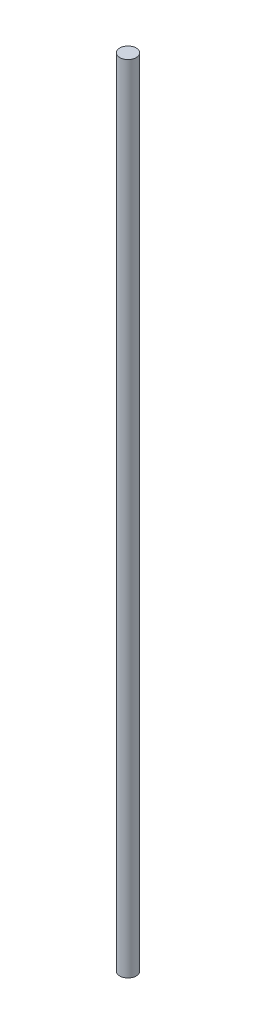
ISO-10303-21;
HEADER;
FILE_DESCRIPTION(('STEP AP214'),'2;1');
FILE_NAME('part.step','',(''),(''),'','','');
FILE_SCHEMA(('AUTOMOTIVE_DESIGN { 1 0 10303 214 1 1 1 1 }'));
ENDSEC;
DATA;
#1=APPLICATION_CONTEXT('core data for automotive mechanical design processes');
#2=APPLICATION_PROTOCOL_DEFINITION('international standard','automotive_design',2000,#1);
#3=PRODUCT_CONTEXT('',#1,'mechanical');
#4=PRODUCT('Part','Part','',(#3));
#5=PRODUCT_RELATED_PRODUCT_CATEGORY('part','',(#4));
#6=PRODUCT_DEFINITION_FORMATION('','',#4);
#7=PRODUCT_DEFINITION_CONTEXT('part definition',#1,'design');
#8=PRODUCT_DEFINITION('design','',#6,#7);
#9=PRODUCT_DEFINITION_SHAPE('','',#8);
#10=(LENGTH_UNIT() NAMED_UNIT(*) SI_UNIT(.MILLI.,.METRE.));
#11=(NAMED_UNIT(*) PLANE_ANGLE_UNIT() SI_UNIT($,.RADIAN.));
#12=(NAMED_UNIT(*) SI_UNIT($,.STERADIAN.) SOLID_ANGLE_UNIT());
#13=UNCERTAINTY_MEASURE_WITH_UNIT(LENGTH_MEASURE(1.E-05),#10,'distance_accuracy_value','');
#14=(GEOMETRIC_REPRESENTATION_CONTEXT(3) GLOBAL_UNCERTAINTY_ASSIGNED_CONTEXT((#13)) GLOBAL_UNIT_ASSIGNED_CONTEXT((#10,
#11,#12)) REPRESENTATION_CONTEXT('',''));
#15=CARTESIAN_POINT('',(0.,0.,0.));
#16=DIRECTION('',(0.,0.,1.));
#17=DIRECTION('',(1.,0.,0.));
#18=AXIS2_PLACEMENT_3D('',#15,#16,#17);
#19=CARTESIAN_POINT('',(0.,609.6,0.));
#20=DIRECTION('',(0.,-1.,0.));
#21=DIRECTION('',(0.,0.,-1.));
#22=AXIS2_PLACEMENT_3D('',#19,#20,#21);
#23=CYLINDRICAL_SURFACE('',#22,6.35);
#24=CARTESIAN_POINT('',(0.,609.6,0.));
#25=DIRECTION('',(0.,1.,0.));
#26=DIRECTION('',(0.,0.,1.));
#27=AXIS2_PLACEMENT_3D('',#24,#25,#26);
#28=CIRCLE('',#27,6.35);
#29=CARTESIAN_POINT('',(0.,609.6,6.35));
#30=VERTEX_POINT('',#29);
#31=EDGE_CURVE('E10',#30,#30,#28,.T.);
#32=ORIENTED_EDGE('',*,*,#31,.F.);
#33=EDGE_LOOP('',(#32));
#34=FACE_BOUND('',#33,.T.);
#35=CARTESIAN_POINT('',(0.,0.,0.));
#36=DIRECTION('',(0.,1.,0.));
#37=DIRECTION('',(0.,0.,1.));
#38=AXIS2_PLACEMENT_3D('',#35,#36,#37);
#39=CIRCLE('',#38,6.35);
#40=CARTESIAN_POINT('',(0.,0.,6.35));
#41=VERTEX_POINT('',#40);
#42=EDGE_CURVE('E34',#41,#41,#39,.T.);
#43=ORIENTED_EDGE('',*,*,#42,.T.);
#44=EDGE_LOOP('',(#43));
#45=FACE_BOUND('',#44,.T.);
#46=ADVANCED_FACE('F31',(#34,#45),#23,.T.);
#47=CARTESIAN_POINT('',(0.,609.6,0.));
#48=DIRECTION('',(0.,1.,0.));
#49=DIRECTION('',(0.,0.,1.));
#50=AXIS2_PLACEMENT_3D('',#47,#48,#49);
#51=PLANE('',#50);
#52=ORIENTED_EDGE('',*,*,#31,.T.);
#53=EDGE_LOOP('',(#52));
#54=FACE_BOUND('',#53,.T.);
#55=ADVANCED_FACE('F46',(#54),#51,.T.);
#56=CARTESIAN_POINT('',(0.,0.,0.));
#57=DIRECTION('',(0.,1.,0.));
#58=DIRECTION('',(0.,0.,1.));
#59=AXIS2_PLACEMENT_3D('',#56,#57,#58);
#60=PLANE('',#59);
#61=ORIENTED_EDGE('',*,*,#42,.F.);
#62=EDGE_LOOP('',(#61));
#63=FACE_BOUND('',#62,.T.);
#64=ADVANCED_FACE('F44',(#63),#60,.F.);
#65=CLOSED_SHELL('',(#46,#55,#64));
#66=MANIFOLD_SOLID_BREP('B2',#65);
#67=ADVANCED_BREP_SHAPE_REPRESENTATION('',(#18,#66),#14);
#68=SHAPE_DEFINITION_REPRESENTATION(#9,#67);
ENDSEC;
END-ISO-10303-21;
